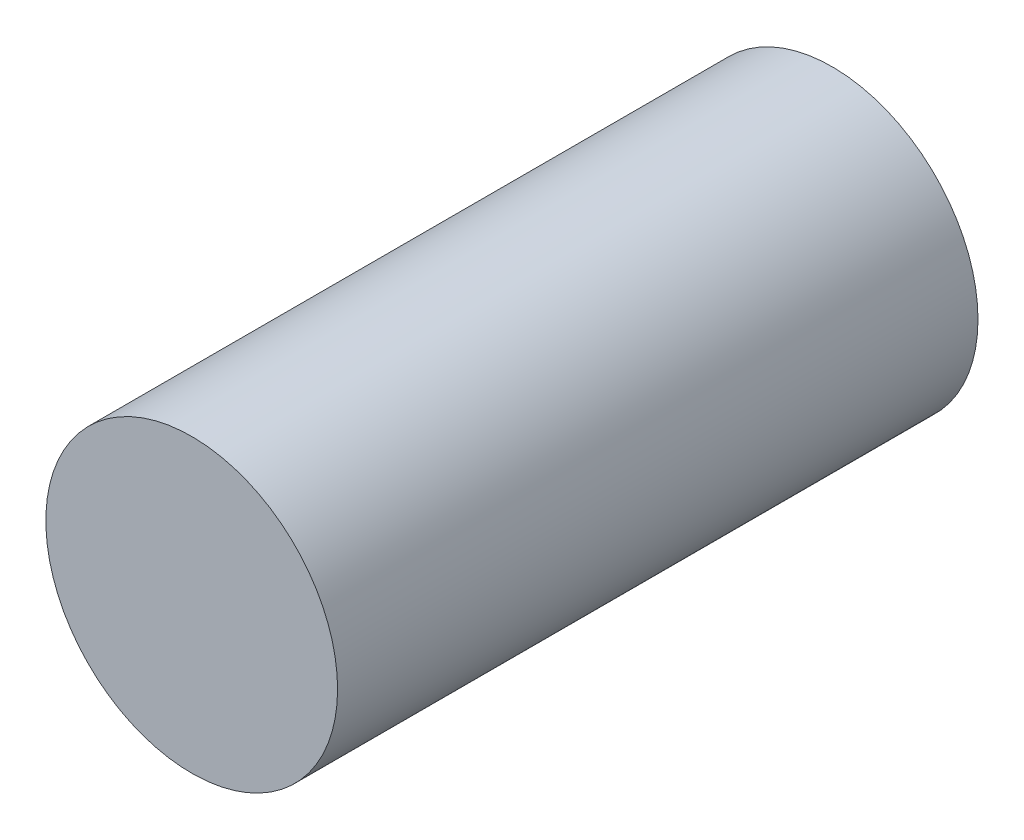
ISO-10303-21;
HEADER;
FILE_DESCRIPTION(('STEP AP214'),'2;1');
FILE_NAME('part.step','',(''),(''),'','','');
FILE_SCHEMA(('AUTOMOTIVE_DESIGN { 1 0 10303 214 1 1 1 1 }'));
ENDSEC;
DATA;
#1=APPLICATION_CONTEXT('core data for automotive mechanical design processes');
#2=APPLICATION_PROTOCOL_DEFINITION('international standard','automotive_design',2000,#1);
#3=PRODUCT_CONTEXT('',#1,'mechanical');
#4=PRODUCT('Part','Part','',(#3));
#5=PRODUCT_RELATED_PRODUCT_CATEGORY('part','',(#4));
#6=PRODUCT_DEFINITION_FORMATION('','',#4);
#7=PRODUCT_DEFINITION_CONTEXT('part definition',#1,'design');
#8=PRODUCT_DEFINITION('design','',#6,#7);
#9=PRODUCT_DEFINITION_SHAPE('','',#8);
#10=(LENGTH_UNIT() NAMED_UNIT(*) SI_UNIT(.MILLI.,.METRE.));
#11=(NAMED_UNIT(*) PLANE_ANGLE_UNIT() SI_UNIT($,.RADIAN.));
#12=(NAMED_UNIT(*) SI_UNIT($,.STERADIAN.) SOLID_ANGLE_UNIT());
#13=UNCERTAINTY_MEASURE_WITH_UNIT(LENGTH_MEASURE(1.E-05),#10,'distance_accuracy_value','');
#14=(GEOMETRIC_REPRESENTATION_CONTEXT(3) GLOBAL_UNCERTAINTY_ASSIGNED_CONTEXT((#13)) GLOBAL_UNIT_ASSIGNED_CONTEXT((#10,
#11,#12)) REPRESENTATION_CONTEXT('',''));
#15=CARTESIAN_POINT('',(0.,0.,0.));
#16=DIRECTION('',(0.,0.,1.));
#17=DIRECTION('',(1.,0.,0.));
#18=AXIS2_PLACEMENT_3D('',#15,#16,#17);
#19=CARTESIAN_POINT('',(5.08,-1.27,0.1));
#20=DIRECTION('',(0.,0.,1.));
#21=DIRECTION('',(1.,0.,0.));
#22=AXIS2_PLACEMENT_3D('',#19,#20,#21);
#23=PLANE('',#22);
#24=CARTESIAN_POINT('',(5.08,-1.27,0.1));
#25=DIRECTION('',(0.,0.,1.));
#26=DIRECTION('',(1.,0.,0.));
#27=AXIS2_PLACEMENT_3D('',#24,#25,#26);
#28=CIRCLE('',#27,0.41);
#29=CARTESIAN_POINT('',(5.49,-1.27,0.1));
#30=VERTEX_POINT('',#29);
#31=EDGE_CURVE('E17',#30,#30,#28,.F.);
#32=ORIENTED_EDGE('',*,*,#31,.F.);
#33=EDGE_LOOP('',(#32));
#34=FACE_BOUND('',#33,.T.);
#35=ADVANCED_FACE('F14',(#34),#23,.T.);
#36=CARTESIAN_POINT('',(5.08,-1.27,-1.7));
#37=DIRECTION('',(0.,0.,1.));
#38=DIRECTION('',(1.,0.,0.));
#39=AXIS2_PLACEMENT_3D('',#36,#37,#38);
#40=PLANE('',#39);
#41=CARTESIAN_POINT('',(5.08,-1.27,-1.7));
#42=DIRECTION('',(0.,0.,1.));
#43=DIRECTION('',(1.,0.,0.));
#44=AXIS2_PLACEMENT_3D('',#41,#42,#43);
#45=CIRCLE('',#44,0.41);
#46=CARTESIAN_POINT('',(5.49,-1.27,-1.7));
#47=VERTEX_POINT('',#46);
#48=EDGE_CURVE('E10',#47,#47,#45,.T.);
#49=ORIENTED_EDGE('',*,*,#48,.F.);
#50=EDGE_LOOP('',(#49));
#51=FACE_BOUND('',#50,.T.);
#52=ADVANCED_FACE('F29',(#51),#40,.F.);
#53=CARTESIAN_POINT('',(5.08,-1.27,-1.7));
#54=DIRECTION('',(0.,0.,1.));
#55=DIRECTION('',(1.,0.,0.));
#56=AXIS2_PLACEMENT_3D('',#53,#54,#55);
#57=CYLINDRICAL_SURFACE('',#56,0.41);
#58=ORIENTED_EDGE('',*,*,#48,.T.);
#59=EDGE_LOOP('',(#58));
#60=FACE_BOUND('',#59,.T.);
#61=ORIENTED_EDGE('',*,*,#31,.T.);
#62=EDGE_LOOP('',(#61));
#63=FACE_BOUND('',#62,.T.);
#64=ADVANCED_FACE('F26',(#60,#63),#57,.T.);
#65=CLOSED_SHELL('',(#35,#52,#64));
#66=MANIFOLD_SOLID_BREP('B1',#65);
#67=ADVANCED_BREP_SHAPE_REPRESENTATION('',(#18,#66),#14);
#68=SHAPE_DEFINITION_REPRESENTATION(#9,#67);
ENDSEC;
END-ISO-10303-21;
